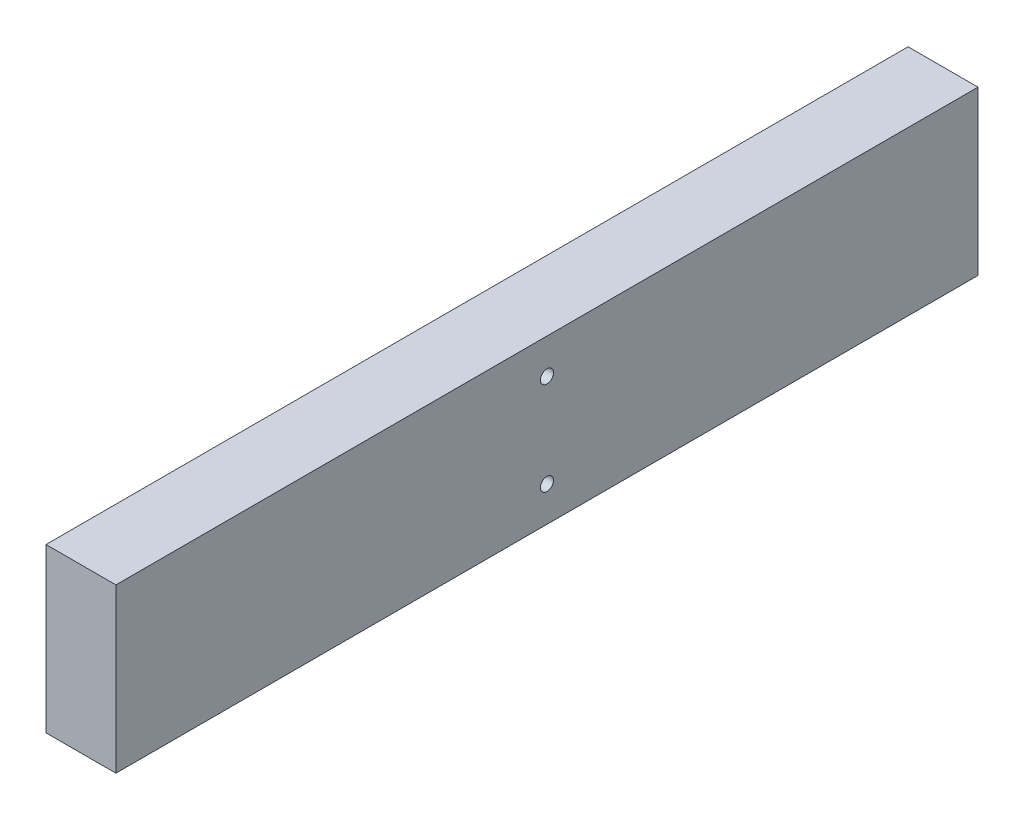
ISO-10303-21;
HEADER;
FILE_DESCRIPTION(('STEP AP214'),'2;1');
FILE_NAME('part.step','',(''),(''),'','','');
FILE_SCHEMA(('AUTOMOTIVE_DESIGN { 1 0 10303 214 1 1 1 1 }'));
ENDSEC;
DATA;
#1=APPLICATION_CONTEXT('core data for automotive mechanical design processes');
#2=APPLICATION_PROTOCOL_DEFINITION('international standard','automotive_design',2000,#1);
#3=PRODUCT_CONTEXT('',#1,'mechanical');
#4=PRODUCT('Part','Part','',(#3));
#5=PRODUCT_RELATED_PRODUCT_CATEGORY('part','',(#4));
#6=PRODUCT_DEFINITION_FORMATION('','',#4);
#7=PRODUCT_DEFINITION_CONTEXT('part definition',#1,'design');
#8=PRODUCT_DEFINITION('design','',#6,#7);
#9=PRODUCT_DEFINITION_SHAPE('','',#8);
#10=(LENGTH_UNIT() NAMED_UNIT(*) SI_UNIT(.MILLI.,.METRE.));
#11=(NAMED_UNIT(*) PLANE_ANGLE_UNIT() SI_UNIT($,.RADIAN.));
#12=(NAMED_UNIT(*) SI_UNIT($,.STERADIAN.) SOLID_ANGLE_UNIT());
#13=UNCERTAINTY_MEASURE_WITH_UNIT(LENGTH_MEASURE(1.E-05),#10,'distance_accuracy_value','');
#14=(GEOMETRIC_REPRESENTATION_CONTEXT(3) GLOBAL_UNCERTAINTY_ASSIGNED_CONTEXT((#13)) GLOBAL_UNIT_ASSIGNED_CONTEXT((#10,
#11,#12)) REPRESENTATION_CONTEXT('',''));
#15=CARTESIAN_POINT('',(0.,0.,0.));
#16=DIRECTION('',(0.,0.,1.));
#17=DIRECTION('',(1.,0.,0.));
#18=AXIS2_PLACEMENT_3D('',#15,#16,#17);
#19=CARTESIAN_POINT('',(19.05,-44.45,469.9));
#20=DIRECTION('',(-1.,0.,0.));
#21=DIRECTION('',(0.,0.,1.));
#22=AXIS2_PLACEMENT_3D('',#19,#20,#21);
#23=PLANE('',#22);
#24=CARTESIAN_POINT('',(19.05,25.4,234.95));
#25=DIRECTION('',(1.,0.,0.));
#26=DIRECTION('',(0.,0.,-1.));
#27=AXIS2_PLACEMENT_3D('',#24,#25,#26);
#28=CIRCLE('',#27,3.571875);
#29=CARTESIAN_POINT('',(19.05,25.4,231.378125));
#30=VERTEX_POINT('',#29);
#31=EDGE_CURVE('E118',#30,#30,#28,.T.);
#32=ORIENTED_EDGE('',*,*,#31,.F.);
#33=EDGE_LOOP('',(#32));
#34=FACE_BOUND('',#33,.T.);
#35=CARTESIAN_POINT('',(19.05,-25.4,234.95));
#36=DIRECTION('',(1.,0.,0.));
#37=DIRECTION('',(0.,0.,-1.));
#38=AXIS2_PLACEMENT_3D('',#35,#36,#37);
#39=CIRCLE('',#38,3.571875);
#40=CARTESIAN_POINT('',(19.05,-25.4,231.378125));
#41=VERTEX_POINT('',#40);
#42=EDGE_CURVE('E112',#41,#41,#39,.T.);
#43=ORIENTED_EDGE('',*,*,#42,.F.);
#44=EDGE_LOOP('',(#43));
#45=FACE_BOUND('',#44,.T.);
#46=DIRECTION('',(0.,1.,0.));
#47=VECTOR('',#46,1.);
#48=CARTESIAN_POINT('',(19.05,-44.45,0.));
#49=LINE('',#48,#47);
#50=CARTESIAN_POINT('',(19.05,-44.45,0.));
#51=VERTEX_POINT('',#50);
#52=CARTESIAN_POINT('',(19.05,44.45,0.));
#53=VERTEX_POINT('',#52);
#54=EDGE_CURVE('E96',#51,#53,#49,.T.);
#55=ORIENTED_EDGE('',*,*,#54,.T.);
#56=DIRECTION('',(0.,0.,-1.));
#57=VECTOR('',#56,1.);
#58=CARTESIAN_POINT('',(19.05,44.45,469.9));
#59=LINE('',#58,#57);
#60=CARTESIAN_POINT('',(19.05,44.45,469.9));
#61=VERTEX_POINT('',#60);
#62=EDGE_CURVE('E11',#61,#53,#59,.T.);
#63=ORIENTED_EDGE('',*,*,#62,.F.);
#64=DIRECTION('',(0.,1.,0.));
#65=VECTOR('',#64,1.);
#66=CARTESIAN_POINT('',(19.05,-44.45,469.9));
#67=LINE('',#66,#65);
#68=CARTESIAN_POINT('',(19.05,-44.45,469.9));
#69=VERTEX_POINT('',#68);
#70=EDGE_CURVE('E84',#69,#61,#67,.T.);
#71=ORIENTED_EDGE('',*,*,#70,.F.);
#72=DIRECTION('',(0.,0.,-1.));
#73=VECTOR('',#72,1.);
#74=CARTESIAN_POINT('',(19.05,-44.45,469.9));
#75=LINE('',#74,#73);
#76=EDGE_CURVE('E92',#69,#51,#75,.T.);
#77=ORIENTED_EDGE('',*,*,#76,.T.);
#78=EDGE_LOOP('',(#55,#63,#71,#77));
#79=FACE_BOUND('',#78,.T.);
#80=ADVANCED_FACE('F33',(#34,#45,#79),#23,.F.);
#81=CARTESIAN_POINT('',(-19.05,44.45,469.9));
#82=DIRECTION('',(0.,-1.,0.));
#83=DIRECTION('',(0.,0.,-1.));
#84=AXIS2_PLACEMENT_3D('',#81,#82,#83);
#85=PLANE('',#84);
#86=DIRECTION('',(-1.,0.,0.));
#87=VECTOR('',#86,1.);
#88=CARTESIAN_POINT('',(-19.05,44.45,0.));
#89=LINE('',#88,#87);
#90=CARTESIAN_POINT('',(-19.05,44.45,0.));
#91=VERTEX_POINT('',#90);
#92=EDGE_CURVE('E88',#53,#91,#89,.T.);
#93=ORIENTED_EDGE('',*,*,#92,.T.);
#94=DIRECTION('',(0.,0.,-1.));
#95=VECTOR('',#94,1.);
#96=CARTESIAN_POINT('',(-19.05,44.45,469.9));
#97=LINE('',#96,#95);
#98=CARTESIAN_POINT('',(-19.05,44.45,469.9));
#99=VERTEX_POINT('',#98);
#100=EDGE_CURVE('E41',#99,#91,#97,.T.);
#101=ORIENTED_EDGE('',*,*,#100,.F.);
#102=DIRECTION('',(-1.,0.,0.));
#103=VECTOR('',#102,1.);
#104=CARTESIAN_POINT('',(-19.05,44.45,469.9));
#105=LINE('',#104,#103);
#106=EDGE_CURVE('E79',#61,#99,#105,.T.);
#107=ORIENTED_EDGE('',*,*,#106,.F.);
#108=ORIENTED_EDGE('',*,*,#62,.T.);
#109=EDGE_LOOP('',(#93,#101,#107,#108));
#110=FACE_BOUND('',#109,.T.);
#111=ADVANCED_FACE('F87',(#110),#85,.F.);
#112=CARTESIAN_POINT('',(-19.05,-44.45,469.9));
#113=DIRECTION('',(1.,0.,0.));
#114=DIRECTION('',(0.,0.,-1.));
#115=AXIS2_PLACEMENT_3D('',#112,#113,#114);
#116=PLANE('',#115);
#117=CARTESIAN_POINT('',(-19.05,25.4,234.95));
#118=DIRECTION('',(1.,0.,0.));
#119=DIRECTION('',(0.,0.,-1.));
#120=AXIS2_PLACEMENT_3D('',#117,#118,#119);
#121=CIRCLE('',#120,3.57187499999999);
#122=CARTESIAN_POINT('',(-19.05,25.4,231.378125));
#123=VERTEX_POINT('',#122);
#124=EDGE_CURVE('E115',#123,#123,#121,.T.);
#125=ORIENTED_EDGE('',*,*,#124,.T.);
#126=EDGE_LOOP('',(#125));
#127=FACE_BOUND('',#126,.T.);
#128=CARTESIAN_POINT('',(-19.05,-25.4,234.95));
#129=DIRECTION('',(1.,0.,0.));
#130=DIRECTION('',(0.,0.,-1.));
#131=AXIS2_PLACEMENT_3D('',#128,#129,#130);
#132=CIRCLE('',#131,3.57187499999999);
#133=CARTESIAN_POINT('',(-19.05,-25.4,231.378125));
#134=VERTEX_POINT('',#133);
#135=EDGE_CURVE('E99',#134,#134,#132,.T.);
#136=ORIENTED_EDGE('',*,*,#135,.T.);
#137=EDGE_LOOP('',(#136));
#138=FACE_BOUND('',#137,.T.);
#139=DIRECTION('',(0.,-1.,0.));
#140=VECTOR('',#139,1.);
#141=CARTESIAN_POINT('',(-19.05,-44.45,0.));
#142=LINE('',#141,#140);
#143=CARTESIAN_POINT('',(-19.05,-44.45,0.));
#144=VERTEX_POINT('',#143);
#145=EDGE_CURVE('E66',#91,#144,#142,.T.);
#146=ORIENTED_EDGE('',*,*,#145,.T.);
#147=DIRECTION('',(0.,0.,-1.));
#148=VECTOR('',#147,1.);
#149=CARTESIAN_POINT('',(-19.05,-44.45,469.9));
#150=LINE('',#149,#148);
#151=CARTESIAN_POINT('',(-19.05,-44.45,469.9));
#152=VERTEX_POINT('',#151);
#153=EDGE_CURVE('E89',#152,#144,#150,.T.);
#154=ORIENTED_EDGE('',*,*,#153,.F.);
#155=DIRECTION('',(0.,-1.,0.));
#156=VECTOR('',#155,1.);
#157=CARTESIAN_POINT('',(-19.05,-44.45,469.9));
#158=LINE('',#157,#156);
#159=EDGE_CURVE('E82',#99,#152,#158,.T.);
#160=ORIENTED_EDGE('',*,*,#159,.F.);
#161=ORIENTED_EDGE('',*,*,#100,.T.);
#162=EDGE_LOOP('',(#146,#154,#160,#161));
#163=FACE_BOUND('',#162,.T.);
#164=ADVANCED_FACE('F90',(#127,#138,#163),#116,.F.);
#165=CARTESIAN_POINT('',(-19.05,-44.45,469.9));
#166=DIRECTION('',(0.,1.,0.));
#167=DIRECTION('',(0.,0.,1.));
#168=AXIS2_PLACEMENT_3D('',#165,#166,#167);
#169=PLANE('',#168);
#170=DIRECTION('',(1.,0.,0.));
#171=VECTOR('',#170,1.);
#172=CARTESIAN_POINT('',(-19.05,-44.45,0.));
#173=LINE('',#172,#171);
#174=EDGE_CURVE('E72',#144,#51,#173,.T.);
#175=ORIENTED_EDGE('',*,*,#174,.T.);
#176=ORIENTED_EDGE('',*,*,#76,.F.);
#177=DIRECTION('',(1.,0.,0.));
#178=VECTOR('',#177,1.);
#179=CARTESIAN_POINT('',(-19.05,-44.45,469.9));
#180=LINE('',#179,#178);
#181=EDGE_CURVE('E49',#152,#69,#180,.T.);
#182=ORIENTED_EDGE('',*,*,#181,.F.);
#183=ORIENTED_EDGE('',*,*,#153,.T.);
#184=EDGE_LOOP('',(#175,#176,#182,#183));
#185=FACE_BOUND('',#184,.T.);
#186=ADVANCED_FACE('F104',(#185),#169,.F.);
#187=CARTESIAN_POINT('',(0.,0.,469.9));
#188=DIRECTION('',(0.,0.,-1.));
#189=DIRECTION('',(-1.,0.,0.));
#190=AXIS2_PLACEMENT_3D('',#187,#188,#189);
#191=PLANE('',#190);
#192=ORIENTED_EDGE('',*,*,#70,.T.);
#193=ORIENTED_EDGE('',*,*,#106,.T.);
#194=ORIENTED_EDGE('',*,*,#159,.T.);
#195=ORIENTED_EDGE('',*,*,#181,.T.);
#196=EDGE_LOOP('',(#192,#193,#194,#195));
#197=FACE_BOUND('',#196,.T.);
#198=ADVANCED_FACE('F80',(#197),#191,.F.);
#199=CARTESIAN_POINT('',(0.,0.,0.));
#200=DIRECTION('',(0.,0.,-1.));
#201=DIRECTION('',(-1.,0.,0.));
#202=AXIS2_PLACEMENT_3D('',#199,#200,#201);
#203=PLANE('',#202);
#204=ORIENTED_EDGE('',*,*,#54,.F.);
#205=ORIENTED_EDGE('',*,*,#174,.F.);
#206=ORIENTED_EDGE('',*,*,#145,.F.);
#207=ORIENTED_EDGE('',*,*,#92,.F.);
#208=EDGE_LOOP('',(#204,#205,#206,#207));
#209=FACE_BOUND('',#208,.T.);
#210=ADVANCED_FACE('F107',(#209),#203,.T.);
#211=CARTESIAN_POINT('',(19.05,-25.4,234.95));
#212=DIRECTION('',(1.,0.,0.));
#213=DIRECTION('',(0.,0.,-1.));
#214=AXIS2_PLACEMENT_3D('',#211,#212,#213);
#215=CYLINDRICAL_SURFACE('',#214,3.57187499999999);
#216=ORIENTED_EDGE('',*,*,#135,.F.);
#217=EDGE_LOOP('',(#216));
#218=FACE_BOUND('',#217,.T.);
#219=ORIENTED_EDGE('',*,*,#42,.T.);
#220=EDGE_LOOP('',(#219));
#221=FACE_BOUND('',#220,.T.);
#222=ADVANCED_FACE('F128',(#218,#221),#215,.F.);
#223=CARTESIAN_POINT('',(19.05,25.4,234.95));
#224=DIRECTION('',(1.,0.,0.));
#225=DIRECTION('',(0.,0.,-1.));
#226=AXIS2_PLACEMENT_3D('',#223,#224,#225);
#227=CYLINDRICAL_SURFACE('',#226,3.57187499999999);
#228=ORIENTED_EDGE('',*,*,#124,.F.);
#229=EDGE_LOOP('',(#228));
#230=FACE_BOUND('',#229,.T.);
#231=ORIENTED_EDGE('',*,*,#31,.T.);
#232=EDGE_LOOP('',(#231));
#233=FACE_BOUND('',#232,.T.);
#234=ADVANCED_FACE('F122',(#230,#233),#227,.F.);
#235=CLOSED_SHELL('',(#80,#111,#164,#186,#198,#210,#222,#234));
#236=MANIFOLD_SOLID_BREP('B2',#235);
#237=ADVANCED_BREP_SHAPE_REPRESENTATION('',(#18,#236),#14);
#238=SHAPE_DEFINITION_REPRESENTATION(#9,#237);
ENDSEC;
END-ISO-10303-21;
